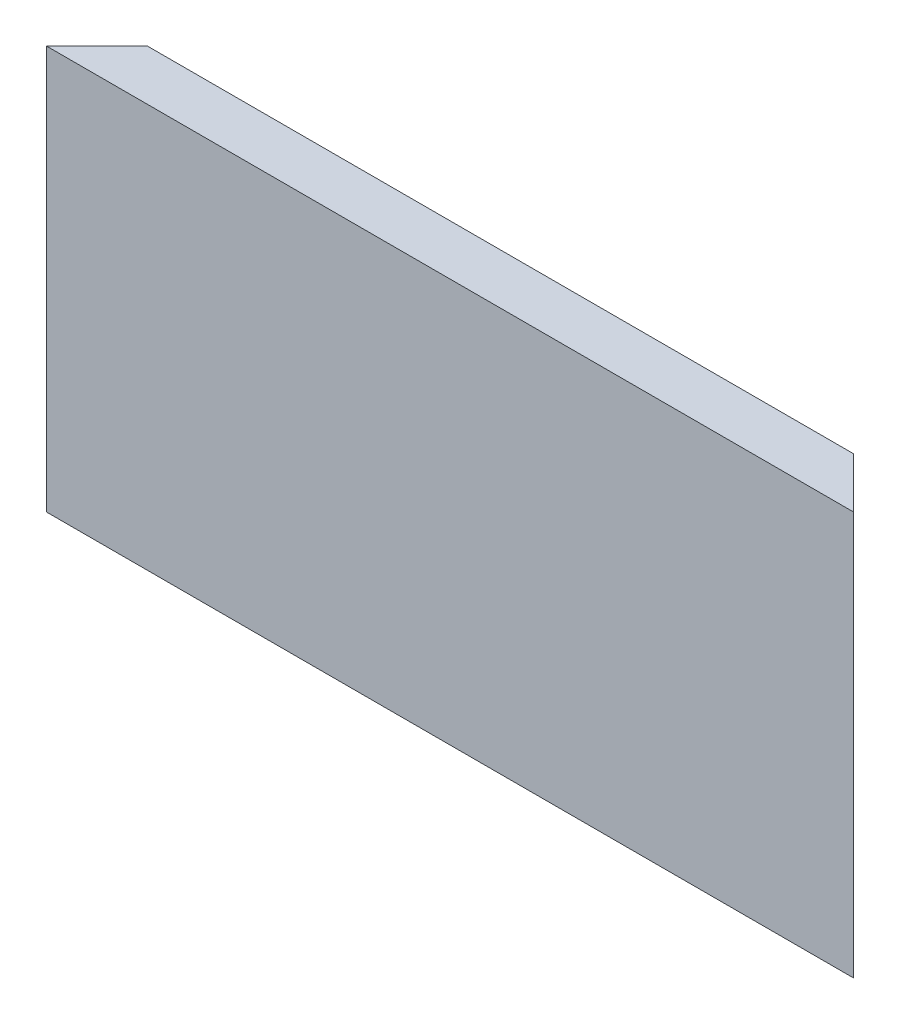
ISO-10303-21;
HEADER;
FILE_DESCRIPTION(('STEP AP214'),'2;1');
FILE_NAME('part.step','',(''),(''),'','','');
FILE_SCHEMA(('AUTOMOTIVE_DESIGN { 1 0 10303 214 1 1 1 1 }'));
ENDSEC;
DATA;
#1=APPLICATION_CONTEXT('core data for automotive mechanical design processes');
#2=APPLICATION_PROTOCOL_DEFINITION('international standard','automotive_design',2000,#1);
#3=PRODUCT_CONTEXT('',#1,'mechanical');
#4=PRODUCT('Part','Part','',(#3));
#5=PRODUCT_RELATED_PRODUCT_CATEGORY('part','',(#4));
#6=PRODUCT_DEFINITION_FORMATION('','',#4);
#7=PRODUCT_DEFINITION_CONTEXT('part definition',#1,'design');
#8=PRODUCT_DEFINITION('design','',#6,#7);
#9=PRODUCT_DEFINITION_SHAPE('','',#8);
#10=(LENGTH_UNIT() NAMED_UNIT(*) SI_UNIT(.MILLI.,.METRE.));
#11=(NAMED_UNIT(*) PLANE_ANGLE_UNIT() SI_UNIT($,.RADIAN.));
#12=(NAMED_UNIT(*) SI_UNIT($,.STERADIAN.) SOLID_ANGLE_UNIT());
#13=UNCERTAINTY_MEASURE_WITH_UNIT(LENGTH_MEASURE(1.E-05),#10,'distance_accuracy_value','');
#14=(GEOMETRIC_REPRESENTATION_CONTEXT(3) GLOBAL_UNCERTAINTY_ASSIGNED_CONTEXT((#13)) GLOBAL_UNIT_ASSIGNED_CONTEXT((#10,
#11,#12)) REPRESENTATION_CONTEXT('',''));
#15=CARTESIAN_POINT('',(0.,0.,0.));
#16=DIRECTION('',(0.,0.,1.));
#17=DIRECTION('',(1.,0.,0.));
#18=AXIS2_PLACEMENT_3D('',#15,#16,#17);
#19=CARTESIAN_POINT('',(80.,20.,-2.5));
#20=DIRECTION('',(0.,0.,1.));
#21=DIRECTION('',(0.,-1.,0.));
#22=AXIS2_PLACEMENT_3D('',#19,#20,#21);
#23=PLANE('',#22);
#24=DIRECTION('',(-1.,0.,0.));
#25=VECTOR('',#24,1.);
#26=CARTESIAN_POINT('',(80.,16.5,-2.5));
#27=LINE('',#26,#25);
#28=CARTESIAN_POINT('',(75.,16.5,-2.5));
#29=VERTEX_POINT('',#28);
#30=CARTESIAN_POINT('',(5.00000000000007,16.5,-2.5));
#31=VERTEX_POINT('',#30);
#32=EDGE_CURVE('E157',#29,#31,#27,.T.);
#33=ORIENTED_EDGE('',*,*,#32,.T.);
#34=DIRECTION('',(0.,1.,0.));
#35=VECTOR('',#34,1.);
#36=CARTESIAN_POINT('',(5.00000000000005,-60.,-2.5));
#37=LINE('',#36,#35);
#38=CARTESIAN_POINT('',(5.00000000000005,20.,-2.5));
#39=VERTEX_POINT('',#38);
#40=EDGE_CURVE('E128',#31,#39,#37,.T.);
#41=ORIENTED_EDGE('',*,*,#40,.T.);
#42=DIRECTION('',(-1.,0.,0.));
#43=VECTOR('',#42,1.);
#44=CARTESIAN_POINT('',(80.,20.,-2.5));
#45=LINE('',#44,#43);
#46=CARTESIAN_POINT('',(75.,20.,-2.5));
#47=VERTEX_POINT('',#46);
#48=EDGE_CURVE('E140',#47,#39,#45,.T.);
#49=ORIENTED_EDGE('',*,*,#48,.F.);
#50=DIRECTION('',(0.,1.,0.));
#51=VECTOR('',#50,1.);
#52=CARTESIAN_POINT('',(75.,-60.,-2.5));
#53=LINE('',#52,#51);
#54=EDGE_CURVE('E118',#29,#47,#53,.T.);
#55=ORIENTED_EDGE('',*,*,#54,.F.);
#56=EDGE_LOOP('',(#33,#41,#49,#55));
#57=FACE_BOUND('',#56,.T.);
#58=ADVANCED_FACE('F33',(#57),#23,.F.);
#59=DIRECTION('',(-1.,0.,0.));
#60=VECTOR('',#59,1.);
#61=CARTESIAN_POINT('',(80.,13.5,-2.5));
#62=LINE('',#61,#60);
#63=CARTESIAN_POINT('',(75.,13.5,-2.5));
#64=VERTEX_POINT('',#63);
#65=CARTESIAN_POINT('',(5.00000000000007,13.5,-2.5));
#66=VERTEX_POINT('',#65);
#67=EDGE_CURVE('E98',#64,#66,#62,.T.);
#68=ORIENTED_EDGE('',*,*,#67,.F.);
#69=CARTESIAN_POINT('',(75.,-14.9999999999999,-2.5));
#70=VERTEX_POINT('',#69);
#71=EDGE_CURVE('E109',#70,#64,#53,.T.);
#72=ORIENTED_EDGE('',*,*,#71,.F.);
#73=DIRECTION('',(-1.,0.,0.));
#74=VECTOR('',#73,1.);
#75=CARTESIAN_POINT('',(80.,-14.9999999999999,-2.5));
#76=LINE('',#75,#74);
#77=CARTESIAN_POINT('',(5.00000000000005,-14.9999999999999,-2.5));
#78=VERTEX_POINT('',#77);
#79=EDGE_CURVE('E143',#70,#78,#76,.T.);
#80=ORIENTED_EDGE('',*,*,#79,.T.);
#81=EDGE_CURVE('E111',#78,#66,#37,.T.);
#82=ORIENTED_EDGE('',*,*,#81,.T.);
#83=EDGE_LOOP('',(#68,#72,#80,#82));
#84=FACE_BOUND('',#83,.T.);
#85=ADVANCED_FACE('F107',(#84),#23,.F.);
#86=CARTESIAN_POINT('',(0.,-60.,2.5));
#87=DIRECTION('',(0.707106781186544,0.,0.707106781186551));
#88=DIRECTION('',(0.707106781186551,0.,-0.707106781186544));
#89=AXIS2_PLACEMENT_3D('',#86,#87,#88);
#90=PLANE('',#89);
#91=DIRECTION('',(0.707106781186551,0.,-0.707106781186544));
#92=VECTOR('',#91,1.);
#93=CARTESIAN_POINT('',(0.,16.5,2.5));
#94=LINE('',#93,#92);
#95=CARTESIAN_POINT('',(2.00000000000002,16.5,0.500000000000002));
#96=VERTEX_POINT('',#95);
#97=EDGE_CURVE('E129',#96,#31,#94,.T.);
#98=ORIENTED_EDGE('',*,*,#97,.F.);
#99=DIRECTION('',(0.,1.,0.));
#100=VECTOR('',#99,1.);
#101=CARTESIAN_POINT('',(2.00000000000003,-60.,0.499999999999991));
#102=LINE('',#101,#100);
#103=CARTESIAN_POINT('',(2.00000000000005,13.5,0.499999999999992));
#104=VERTEX_POINT('',#103);
#105=EDGE_CURVE('E171',#104,#96,#102,.T.);
#106=ORIENTED_EDGE('',*,*,#105,.F.);
#107=DIRECTION('',(-0.707106781186551,0.,0.707106781186544));
#108=VECTOR('',#107,1.);
#109=CARTESIAN_POINT('',(0.,13.5,2.5));
#110=LINE('',#109,#108);
#111=EDGE_CURVE('E170',#66,#104,#110,.T.);
#112=ORIENTED_EDGE('',*,*,#111,.F.);
#113=ORIENTED_EDGE('',*,*,#81,.F.);
#114=DIRECTION('',(0.577350269189628,0.577350269189628,-0.577350269189622));
#115=VECTOR('',#114,1.);
#116=CARTESIAN_POINT('',(26.6666666666668,6.66666666666687,-24.1666666666666));
#117=LINE('',#116,#115);
#118=CARTESIAN_POINT('',(0.,-20.,2.5));
#119=VERTEX_POINT('',#118);
#120=EDGE_CURVE('E117',#119,#78,#117,.T.);
#121=ORIENTED_EDGE('',*,*,#120,.F.);
#122=DIRECTION('',(0.,-1.,0.));
#123=VECTOR('',#122,1.);
#124=CARTESIAN_POINT('',(0.,20.,2.5));
#125=LINE('',#124,#123);
#126=CARTESIAN_POINT('',(0.,20.,2.5));
#127=VERTEX_POINT('',#126);
#128=EDGE_CURVE('E132',#127,#119,#125,.T.);
#129=ORIENTED_EDGE('',*,*,#128,.F.);
#130=DIRECTION('',(0.707106781186551,0.,-0.707106781186544));
#131=VECTOR('',#130,1.);
#132=CARTESIAN_POINT('',(0.,20.,2.5));
#133=LINE('',#132,#131);
#134=EDGE_CURVE('E125',#127,#39,#133,.T.);
#135=ORIENTED_EDGE('',*,*,#134,.T.);
#136=ORIENTED_EDGE('',*,*,#40,.F.);
#137=EDGE_LOOP('',(#98,#106,#112,#113,#121,#129,#135,#136));
#138=FACE_BOUND('',#137,.T.);
#139=ADVANCED_FACE('F169',(#138),#90,.F.);
#140=CARTESIAN_POINT('',(80.,-60.,2.5));
#141=DIRECTION('',(-0.707106781186548,0.,0.707106781186547));
#142=DIRECTION('',(0.707106781186547,0.,0.707106781186548));
#143=AXIS2_PLACEMENT_3D('',#140,#141,#142);
#144=PLANE('',#143);
#145=DIRECTION('',(0.707106781186547,0.,0.707106781186548));
#146=VECTOR('',#145,1.);
#147=CARTESIAN_POINT('',(80.,16.5,2.5));
#148=LINE('',#147,#146);
#149=CARTESIAN_POINT('',(78.,16.5,0.500000000000002));
#150=VERTEX_POINT('',#149);
#151=EDGE_CURVE('E11',#29,#150,#148,.T.);
#152=ORIENTED_EDGE('',*,*,#151,.F.);
#153=ORIENTED_EDGE('',*,*,#54,.T.);
#154=DIRECTION('',(0.707106781186547,0.,0.707106781186548));
#155=VECTOR('',#154,1.);
#156=CARTESIAN_POINT('',(80.,20.,2.5));
#157=LINE('',#156,#155);
#158=CARTESIAN_POINT('',(80.,20.,2.5));
#159=VERTEX_POINT('',#158);
#160=EDGE_CURVE('E57',#47,#159,#157,.T.);
#161=ORIENTED_EDGE('',*,*,#160,.T.);
#162=DIRECTION('',(0.,-1.,0.));
#163=VECTOR('',#162,1.);
#164=CARTESIAN_POINT('',(80.,20.,2.5));
#165=LINE('',#164,#163);
#166=CARTESIAN_POINT('',(80.,-20.,2.5));
#167=VERTEX_POINT('',#166);
#168=EDGE_CURVE('E133',#159,#167,#165,.T.);
#169=ORIENTED_EDGE('',*,*,#168,.T.);
#170=DIRECTION('',(0.577350269189623,-0.577350269189631,0.577350269189624));
#171=VECTOR('',#170,1.);
#172=CARTESIAN_POINT('',(80.,-20.,2.5));
#173=LINE('',#172,#171);
#174=EDGE_CURVE('E116',#70,#167,#173,.T.);
#175=ORIENTED_EDGE('',*,*,#174,.F.);
#176=ORIENTED_EDGE('',*,*,#71,.T.);
#177=DIRECTION('',(-0.707106781186547,0.,-0.707106781186548));
#178=VECTOR('',#177,1.);
#179=CARTESIAN_POINT('',(80.,13.5,2.5));
#180=LINE('',#179,#178);
#181=CARTESIAN_POINT('',(78.,13.5,0.500000000000001));
#182=VERTEX_POINT('',#181);
#183=EDGE_CURVE('E95',#182,#64,#180,.T.);
#184=ORIENTED_EDGE('',*,*,#183,.F.);
#185=DIRECTION('',(0.,-1.,0.));
#186=VECTOR('',#185,1.);
#187=CARTESIAN_POINT('',(78.,-60.,0.499999999999991));
#188=LINE('',#187,#186);
#189=EDGE_CURVE('E41',#150,#182,#188,.T.);
#190=ORIENTED_EDGE('',*,*,#189,.F.);
#191=EDGE_LOOP('',(#152,#153,#161,#169,#175,#176,#184,#190));
#192=FACE_BOUND('',#191,.T.);
#193=ADVANCED_FACE('F114',(#192),#144,.F.);
#194=CARTESIAN_POINT('',(80.,20.,2.5));
#195=DIRECTION('',(0.,0.,-1.));
#196=DIRECTION('',(0.,1.,0.));
#197=AXIS2_PLACEMENT_3D('',#194,#195,#196);
#198=PLANE('',#197);
#199=ORIENTED_EDGE('',*,*,#128,.T.);
#200=DIRECTION('',(-1.,0.,0.));
#201=VECTOR('',#200,1.);
#202=CARTESIAN_POINT('',(80.,-20.,2.5));
#203=LINE('',#202,#201);
#204=EDGE_CURVE('E102',#167,#119,#203,.T.);
#205=ORIENTED_EDGE('',*,*,#204,.F.);
#206=ORIENTED_EDGE('',*,*,#168,.F.);
#207=DIRECTION('',(-1.,0.,0.));
#208=VECTOR('',#207,1.);
#209=CARTESIAN_POINT('',(80.,20.,2.5));
#210=LINE('',#209,#208);
#211=EDGE_CURVE('E135',#159,#127,#210,.T.);
#212=ORIENTED_EDGE('',*,*,#211,.T.);
#213=EDGE_LOOP('',(#199,#205,#206,#212));
#214=FACE_BOUND('',#213,.T.);
#215=ADVANCED_FACE('F35',(#214),#198,.F.);
#216=CARTESIAN_POINT('',(80.,-20.,2.5));
#217=DIRECTION('',(0.,0.707106781186543,0.707106781186552));
#218=DIRECTION('',(0.,-0.707106781186552,0.707106781186543));
#219=AXIS2_PLACEMENT_3D('',#216,#217,#218);
#220=PLANE('',#219);
#221=ORIENTED_EDGE('',*,*,#79,.F.);
#222=ORIENTED_EDGE('',*,*,#174,.T.);
#223=ORIENTED_EDGE('',*,*,#204,.T.);
#224=ORIENTED_EDGE('',*,*,#120,.T.);
#225=EDGE_LOOP('',(#221,#222,#223,#224));
#226=FACE_BOUND('',#225,.T.);
#227=ADVANCED_FACE('F166',(#226),#220,.F.);
#228=CARTESIAN_POINT('',(80.,20.,2.5));
#229=DIRECTION('',(0.,-1.,0.));
#230=DIRECTION('',(0.,0.,-1.));
#231=AXIS2_PLACEMENT_3D('',#228,#229,#230);
#232=PLANE('',#231);
#233=ORIENTED_EDGE('',*,*,#211,.F.);
#234=ORIENTED_EDGE('',*,*,#160,.F.);
#235=ORIENTED_EDGE('',*,*,#48,.T.);
#236=ORIENTED_EDGE('',*,*,#134,.F.);
#237=EDGE_LOOP('',(#233,#234,#235,#236));
#238=FACE_BOUND('',#237,.T.);
#239=ADVANCED_FACE('F161',(#238),#232,.F.);
#240=CARTESIAN_POINT('',(80.,16.5,-2.5));
#241=DIRECTION('',(0.,-1.,0.));
#242=DIRECTION('',(0.,0.,-1.));
#243=AXIS2_PLACEMENT_3D('',#240,#241,#242);
#244=PLANE('',#243);
#245=ORIENTED_EDGE('',*,*,#97,.T.);
#246=ORIENTED_EDGE('',*,*,#32,.F.);
#247=ORIENTED_EDGE('',*,*,#151,.T.);
#248=DIRECTION('',(-1.,0.,0.));
#249=VECTOR('',#248,1.);
#250=CARTESIAN_POINT('',(80.,16.5,0.500000000000002));
#251=LINE('',#250,#249);
#252=EDGE_CURVE('E151',#150,#96,#251,.T.);
#253=ORIENTED_EDGE('',*,*,#252,.T.);
#254=EDGE_LOOP('',(#245,#246,#247,#253));
#255=FACE_BOUND('',#254,.T.);
#256=ADVANCED_FACE('F176',(#255),#244,.T.);
#257=CARTESIAN_POINT('',(80.,16.5,0.500000000000002));
#258=DIRECTION('',(0.,0.,-1.));
#259=DIRECTION('',(0.,1.,0.));
#260=AXIS2_PLACEMENT_3D('',#257,#258,#259);
#261=PLANE('',#260);
#262=ORIENTED_EDGE('',*,*,#105,.T.);
#263=ORIENTED_EDGE('',*,*,#252,.F.);
#264=ORIENTED_EDGE('',*,*,#189,.T.);
#265=DIRECTION('',(-1.,0.,0.));
#266=VECTOR('',#265,1.);
#267=CARTESIAN_POINT('',(80.,13.5,0.500000000000001));
#268=LINE('',#267,#266);
#269=EDGE_CURVE('E48',#182,#104,#268,.T.);
#270=ORIENTED_EDGE('',*,*,#269,.T.);
#271=EDGE_LOOP('',(#262,#263,#264,#270));
#272=FACE_BOUND('',#271,.T.);
#273=ADVANCED_FACE('F148',(#272),#261,.T.);
#274=CARTESIAN_POINT('',(80.,13.5,-2.5));
#275=DIRECTION('',(0.,1.,0.));
#276=DIRECTION('',(0.,0.,1.));
#277=AXIS2_PLACEMENT_3D('',#274,#275,#276);
#278=PLANE('',#277);
#279=ORIENTED_EDGE('',*,*,#111,.T.);
#280=ORIENTED_EDGE('',*,*,#269,.F.);
#281=ORIENTED_EDGE('',*,*,#183,.T.);
#282=ORIENTED_EDGE('',*,*,#67,.T.);
#283=EDGE_LOOP('',(#279,#280,#281,#282));
#284=FACE_BOUND('',#283,.T.);
#285=ADVANCED_FACE('F97',(#284),#278,.T.);
#286=CLOSED_SHELL('',(#58,#85,#139,#193,#215,#227,#239,#256,#273,#285));
#287=MANIFOLD_SOLID_BREP('B2',#286);
#288=ADVANCED_BREP_SHAPE_REPRESENTATION('',(#18,#287),#14);
#289=SHAPE_DEFINITION_REPRESENTATION(#9,#288);
ENDSEC;
END-ISO-10303-21;
